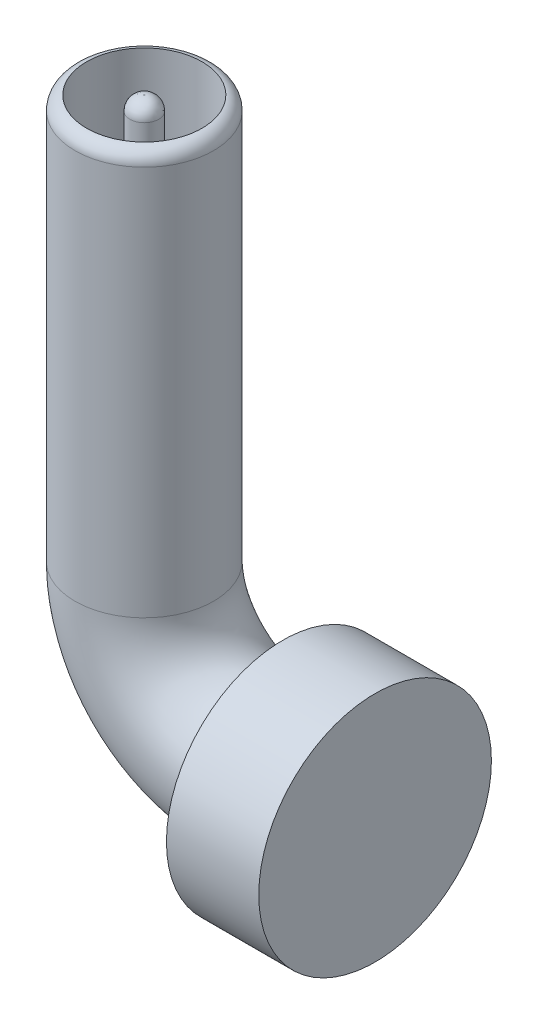
ISO-10303-21;
HEADER;
FILE_DESCRIPTION(('STEP AP214'),'2;1');
FILE_NAME('part.step','',(''),(''),'','','');
FILE_SCHEMA(('AUTOMOTIVE_DESIGN { 1 0 10303 214 1 1 1 1 }'));
ENDSEC;
DATA;
#1=APPLICATION_CONTEXT('core data for automotive mechanical design processes');
#2=APPLICATION_PROTOCOL_DEFINITION('international standard','automotive_design',2000,#1);
#3=PRODUCT_CONTEXT('',#1,'mechanical');
#4=PRODUCT('Part','Part','',(#3));
#5=PRODUCT_RELATED_PRODUCT_CATEGORY('part','',(#4));
#6=PRODUCT_DEFINITION_FORMATION('','',#4);
#7=PRODUCT_DEFINITION_CONTEXT('part definition',#1,'design');
#8=PRODUCT_DEFINITION('design','',#6,#7);
#9=PRODUCT_DEFINITION_SHAPE('','',#8);
#10=(LENGTH_UNIT() NAMED_UNIT(*) SI_UNIT(.MILLI.,.METRE.));
#11=(NAMED_UNIT(*) PLANE_ANGLE_UNIT() SI_UNIT($,.RADIAN.));
#12=(NAMED_UNIT(*) SI_UNIT($,.STERADIAN.) SOLID_ANGLE_UNIT());
#13=UNCERTAINTY_MEASURE_WITH_UNIT(LENGTH_MEASURE(1.E-05),#10,'distance_accuracy_value','');
#14=(GEOMETRIC_REPRESENTATION_CONTEXT(3) GLOBAL_UNCERTAINTY_ASSIGNED_CONTEXT((#13)) GLOBAL_UNIT_ASSIGNED_CONTEXT((#10,
#11,#12)) REPRESENTATION_CONTEXT('',''));
#15=CARTESIAN_POINT('',(0.,0.,0.));
#16=DIRECTION('',(0.,0.,1.));
#17=DIRECTION('',(1.,0.,0.));
#18=AXIS2_PLACEMENT_3D('',#15,#16,#17);
#19=CARTESIAN_POINT('',(-12.7,28.575,0.));
#20=DIRECTION('',(0.,-1.,0.));
#21=DIRECTION('',(1.,0.,0.));
#22=AXIS2_PLACEMENT_3D('',#19,#20,#21);
#23=PLANE('',#22);
#24=CARTESIAN_POINT('',(-12.7,28.575,0.));
#25=DIRECTION('',(0.,-1.,0.));
#26=DIRECTION('',(1.,0.,0.));
#27=AXIS2_PLACEMENT_3D('',#24,#25,#26);
#28=CIRCLE('',#27,0.0317500000000005);
#29=CARTESIAN_POINT('',(-12.66825,28.575,0.));
#30=VERTEX_POINT('',#29);
#31=CARTESIAN_POINT('',(-12.73175,28.575,0.));
#32=VERTEX_POINT('',#31);
#33=EDGE_CURVE('E33',#30,#32,#28,.T.);
#34=ORIENTED_EDGE('',*,*,#33,.F.);
#35=CARTESIAN_POINT('',(-12.7,28.575,0.));
#36=DIRECTION('',(0.,-1.,0.));
#37=DIRECTION('',(-1.,0.,0.));
#38=AXIS2_PLACEMENT_3D('',#35,#36,#37);
#39=CIRCLE('',#38,0.0317499999999953);
#40=EDGE_CURVE('E39',#32,#30,#39,.T.);
#41=ORIENTED_EDGE('',*,*,#40,.F.);
#42=EDGE_LOOP('',(#34,#41));
#43=FACE_BOUND('',#42,.T.);
#44=ADVANCED_FACE('F16',(#43),#23,.F.);
#45=CARTESIAN_POINT('',(-12.66825,27.813,0.));
#46=DIRECTION('',(0.,0.,1.));
#47=DIRECTION('',(1.,0.,0.));
#48=AXIS2_PLACEMENT_3D('',#45,#46,#47);
#49=CIRCLE('',#48,0.762);
#50=TRIMMED_CURVE('',#49,(PARAMETER_VALUE(-1.61247505921747)),
(PARAMETER_VALUE(1.61247505921747)),.T.,.PARAMETER.);
#51=CARTESIAN_POINT('',(-12.7,27.813,0.));
#52=DIRECTION('',(0.,-1.,0.));
#53=AXIS1_PLACEMENT('',#51,#52);
#54=SURFACE_OF_REVOLUTION('',#50,#53);
#55=ORIENTED_EDGE('',*,*,#33,.T.);
#56=ORIENTED_EDGE('',*,*,#40,.T.);
#57=EDGE_LOOP('',(#55,#56));
#58=FACE_BOUND('',#57,.T.);
#59=CARTESIAN_POINT('',(-12.7,27.813,0.));
#60=DIRECTION('',(0.,1.,0.));
#61=DIRECTION('',(-1.,0.,0.));
#62=AXIS2_PLACEMENT_3D('',#59,#60,#61);
#63=CIRCLE('',#62,0.793749999999999);
#64=CARTESIAN_POINT('',(-13.49375,27.813,0.));
#65=VERTEX_POINT('',#64);
#66=EDGE_CURVE('E43',#65,#65,#63,.F.);
#67=ORIENTED_EDGE('',*,*,#66,.F.);
#68=EDGE_LOOP('',(#67));
#69=FACE_BOUND('',#68,.T.);
#70=ADVANCED_FACE('F37',(#58,#69),#54,.F.);
#71=CARTESIAN_POINT('',(0.,0.,0.));
#72=DIRECTION('',(1.,0.,0.));
#73=DIRECTION('',(0.,0.,-1.));
#74=AXIS2_PLACEMENT_3D('',#71,#72,#73);
#75=PLANE('',#74);
#76=CARTESIAN_POINT('',(0.,0.,0.));
#77=DIRECTION('',(1.,0.,0.));
#78=DIRECTION('',(0.,0.,-1.));
#79=AXIS2_PLACEMENT_3D('',#76,#77,#78);
#80=CIRCLE('',#79,6.40181661571805);
#81=CARTESIAN_POINT('',(0.,0.,-6.40181661571805));
#82=VERTEX_POINT('',#81);
#83=EDGE_CURVE('E79',#82,#82,#80,.F.);
#84=ORIENTED_EDGE('',*,*,#83,.F.);
#85=EDGE_LOOP('',(#84));
#86=FACE_BOUND('',#85,.T.);
#87=ADVANCED_FACE('F70',(#86),#75,.T.);
#88=CARTESIAN_POINT('',(-12.7,15.875,0.));
#89=DIRECTION('',(0.,1.,0.));
#90=DIRECTION('',(-1.,0.,0.));
#91=AXIS2_PLACEMENT_3D('',#88,#89,#90);
#92=CYLINDRICAL_SURFACE('',#91,0.793749999999999);
#93=CARTESIAN_POINT('',(-12.7,15.875,0.));
#94=DIRECTION('',(0.,1.,0.));
#95=DIRECTION('',(-1.,0.,0.));
#96=AXIS2_PLACEMENT_3D('',#93,#94,#95);
#97=CIRCLE('',#96,0.793749999999999);
#98=CARTESIAN_POINT('',(-13.49375,15.875,0.));
#99=VERTEX_POINT('',#98);
#100=EDGE_CURVE('E83',#99,#99,#97,.F.);
#101=ORIENTED_EDGE('',*,*,#100,.F.);
#102=EDGE_LOOP('',(#101));
#103=FACE_BOUND('',#102,.T.);
#104=ORIENTED_EDGE('',*,*,#66,.T.);
#105=EDGE_LOOP('',(#104));
#106=FACE_BOUND('',#105,.T.);
#107=ADVANCED_FACE('F133',(#103,#106),#92,.T.);
#108=CARTESIAN_POINT('',(-5.08,0.,0.));
#109=DIRECTION('',(1.,0.,0.));
#110=DIRECTION('',(0.,0.,-1.));
#111=AXIS2_PLACEMENT_3D('',#108,#109,#110);
#112=CYLINDRICAL_SURFACE('',#111,6.40181661571805);
#113=ORIENTED_EDGE('',*,*,#83,.T.);
#114=EDGE_LOOP('',(#113));
#115=FACE_BOUND('',#114,.T.);
#116=CARTESIAN_POINT('',(-5.08,0.,0.));
#117=DIRECTION('',(1.,0.,0.));
#118=DIRECTION('',(0.,0.,-1.));
#119=AXIS2_PLACEMENT_3D('',#116,#117,#118);
#120=CIRCLE('',#119,6.40181661571805);
#121=CARTESIAN_POINT('',(-5.08,0.,-6.40181661571805));
#122=VERTEX_POINT('',#121);
#123=EDGE_CURVE('E87',#122,#122,#120,.T.);
#124=ORIENTED_EDGE('',*,*,#123,.T.);
#125=EDGE_LOOP('',(#124));
#126=FACE_BOUND('',#125,.T.);
#127=ADVANCED_FACE('F131',(#115,#126),#112,.T.);
#128=CARTESIAN_POINT('',(-12.7,15.875,0.));
#129=DIRECTION('',(0.,1.,0.));
#130=DIRECTION('',(-1.,0.,0.));
#131=AXIS2_PLACEMENT_3D('',#128,#129,#130);
#132=PLANE('',#131);
#133=CARTESIAN_POINT('',(-12.7,15.875,0.));
#134=DIRECTION('',(0.,1.,0.));
#135=DIRECTION('',(-1.,0.,0.));
#136=AXIS2_PLACEMENT_3D('',#133,#134,#135);
#137=CIRCLE('',#136,3.175);
#138=CARTESIAN_POINT('',(-15.875,15.875,0.));
#139=VERTEX_POINT('',#138);
#140=EDGE_CURVE('E91',#139,#139,#137,.T.);
#141=ORIENTED_EDGE('',*,*,#140,.T.);
#142=EDGE_LOOP('',(#141));
#143=FACE_BOUND('',#142,.T.);
#144=ORIENTED_EDGE('',*,*,#100,.T.);
#145=EDGE_LOOP('',(#144));
#146=FACE_BOUND('',#145,.T.);
#147=ADVANCED_FACE('F127',(#143,#146),#132,.T.);
#148=CARTESIAN_POINT('',(-5.08,0.,0.));
#149=DIRECTION('',(1.,0.,0.));
#150=DIRECTION('',(0.,0.,-1.));
#151=AXIS2_PLACEMENT_3D('',#148,#149,#150);
#152=PLANE('',#151);
#153=ORIENTED_EDGE('',*,*,#123,.F.);
#154=EDGE_LOOP('',(#153));
#155=FACE_BOUND('',#154,.T.);
#156=CARTESIAN_POINT('',(-5.08,0.,0.));
#157=DIRECTION('',(1.,0.,0.));
#158=DIRECTION('',(0.,1.,0.));
#159=AXIS2_PLACEMENT_3D('',#156,#157,#158);
#160=CIRCLE('',#159,3.81);
#161=CARTESIAN_POINT('',(-5.08,3.81,0.));
#162=VERTEX_POINT('',#161);
#163=EDGE_CURVE('E59',#162,#162,#160,.F.);
#164=ORIENTED_EDGE('',*,*,#163,.F.);
#165=EDGE_LOOP('',(#164));
#166=FACE_BOUND('',#165,.T.);
#167=ADVANCED_FACE('F123',(#155,#166),#152,.F.);
#168=CARTESIAN_POINT('',(-12.7,15.875,0.));
#169=DIRECTION('',(0.,1.,0.));
#170=DIRECTION('',(-1.,0.,0.));
#171=AXIS2_PLACEMENT_3D('',#168,#169,#170);
#172=CYLINDRICAL_SURFACE('',#171,3.175);
#173=ORIENTED_EDGE('',*,*,#140,.F.);
#174=EDGE_LOOP('',(#173));
#175=FACE_BOUND('',#174,.T.);
#176=CARTESIAN_POINT('',(-12.7,28.575,0.));
#177=DIRECTION('',(0.,1.,0.));
#178=DIRECTION('',(-1.,0.,0.));
#179=AXIS2_PLACEMENT_3D('',#176,#177,#178);
#180=CIRCLE('',#179,3.175);
#181=CARTESIAN_POINT('',(-15.875,28.575,0.));
#182=VERTEX_POINT('',#181);
#183=EDGE_CURVE('E96',#182,#182,#180,.F.);
#184=ORIENTED_EDGE('',*,*,#183,.F.);
#185=EDGE_LOOP('',(#184));
#186=FACE_BOUND('',#185,.T.);
#187=ADVANCED_FACE('F120',(#175,#186),#172,.F.);
#188=CARTESIAN_POINT('',(-6.35,0.,0.));
#189=DIRECTION('',(1.,0.,0.));
#190=DIRECTION('',(0.,1.,0.));
#191=AXIS2_PLACEMENT_3D('',#188,#189,#190);
#192=CYLINDRICAL_SURFACE('',#191,3.81);
#193=ORIENTED_EDGE('',*,*,#163,.T.);
#194=EDGE_LOOP('',(#193));
#195=FACE_BOUND('',#194,.T.);
#196=CARTESIAN_POINT('',(-6.35,0.,0.));
#197=DIRECTION('',(-1.,0.,0.));
#198=DIRECTION('',(0.,-1.,0.));
#199=AXIS2_PLACEMENT_3D('',#196,#197,#198);
#200=CIRCLE('',#199,3.81);
#201=CARTESIAN_POINT('',(-6.35,-3.81,0.));
#202=VERTEX_POINT('',#201);
#203=EDGE_CURVE('E100',#202,#202,#200,.T.);
#204=ORIENTED_EDGE('',*,*,#203,.F.);
#205=EDGE_LOOP('',(#204));
#206=FACE_BOUND('',#205,.T.);
#207=ADVANCED_FACE('F116',(#195,#206),#192,.T.);
#208=CARTESIAN_POINT('',(-12.7,27.8236578675463,0.));
#209=DIRECTION('',(0.,1.,0.));
#210=DIRECTION('',(-1.,0.,0.));
#211=AXIS2_PLACEMENT_3D('',#208,#209,#210);
#212=TOROIDAL_SURFACE('',#211,3.048,0.762);
#213=ORIENTED_EDGE('',*,*,#183,.T.);
#214=EDGE_LOOP('',(#213));
#215=FACE_BOUND('',#214,.T.);
#216=CARTESIAN_POINT('',(-12.7,27.8236578675463,0.));
#217=DIRECTION('',(0.,1.,0.));
#218=DIRECTION('',(0.,0.,1.));
#219=AXIS2_PLACEMENT_3D('',#216,#217,#218);
#220=CIRCLE('',#219,3.81);
#221=CARTESIAN_POINT('',(-12.7,27.8236578675463,3.81));
#222=VERTEX_POINT('',#221);
#223=EDGE_CURVE('E10',#222,#222,#220,.F.);
#224=ORIENTED_EDGE('',*,*,#223,.F.);
#225=EDGE_LOOP('',(#224));
#226=FACE_BOUND('',#225,.T.);
#227=ADVANCED_FACE('F111',(#215,#226),#212,.T.);
#228=CARTESIAN_POINT('',(-6.35,6.35,0.));
#229=DIRECTION('',(0.,0.,-1.));
#230=DIRECTION('',(-1.,0.,0.));
#231=AXIS2_PLACEMENT_3D('',#228,#229,#230);
#232=TOROIDAL_SURFACE('',#231,6.35,3.81);
#233=ORIENTED_EDGE('',*,*,#203,.T.);
#234=EDGE_LOOP('',(#233));
#235=FACE_BOUND('',#234,.T.);
#236=CARTESIAN_POINT('',(-12.7,6.35,0.));
#237=DIRECTION('',(0.,1.,0.));
#238=DIRECTION('',(0.,0.,1.));
#239=AXIS2_PLACEMENT_3D('',#236,#237,#238);
#240=CIRCLE('',#239,3.81);
#241=CARTESIAN_POINT('',(-12.7,6.35,3.81));
#242=VERTEX_POINT('',#241);
#243=EDGE_CURVE('E26',#242,#242,#240,.T.);
#244=ORIENTED_EDGE('',*,*,#243,.F.);
#245=EDGE_LOOP('',(#244));
#246=FACE_BOUND('',#245,.T.);
#247=ADVANCED_FACE('F115',(#235,#246),#232,.T.);
#248=CARTESIAN_POINT('',(-12.7,6.35,0.));
#249=DIRECTION('',(0.,1.,0.));
#250=DIRECTION('',(0.,0.,1.));
#251=AXIS2_PLACEMENT_3D('',#248,#249,#250);
#252=CYLINDRICAL_SURFACE('',#251,3.81);
#253=ORIENTED_EDGE('',*,*,#223,.T.);
#254=EDGE_LOOP('',(#253));
#255=FACE_BOUND('',#254,.T.);
#256=ORIENTED_EDGE('',*,*,#243,.T.);
#257=EDGE_LOOP('',(#256));
#258=FACE_BOUND('',#257,.T.);
#259=ADVANCED_FACE('F142',(#255,#258),#252,.T.);
#260=CLOSED_SHELL('',(#44,#70,#87,#107,#127,#147,#167,#187,#207,#227,#247,#259));
#261=MANIFOLD_SOLID_BREP('B1',#260);
#262=ADVANCED_BREP_SHAPE_REPRESENTATION('',(#18,#261),#14);
#263=SHAPE_DEFINITION_REPRESENTATION(#9,#262);
ENDSEC;
END-ISO-10303-21;
